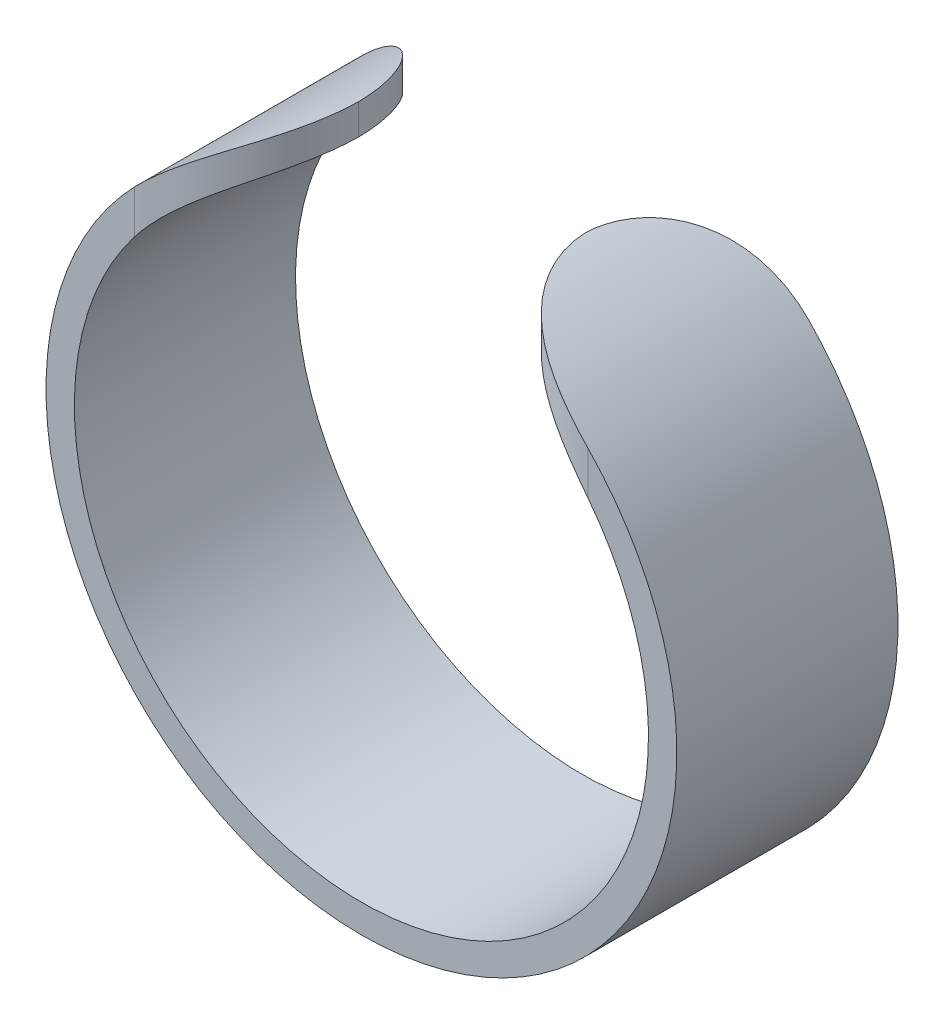
ISO-10303-21;
HEADER;
FILE_DESCRIPTION(('STEP AP214'),'2;1');
FILE_NAME('part.step','',(''),(''),'','','');
FILE_SCHEMA(('AUTOMOTIVE_DESIGN { 1 0 10303 214 1 1 1 1 }'));
ENDSEC;
DATA;
#1=APPLICATION_CONTEXT('core data for automotive mechanical design processes');
#2=APPLICATION_PROTOCOL_DEFINITION('international standard','automotive_design',2000,#1);
#3=PRODUCT_CONTEXT('',#1,'mechanical');
#4=PRODUCT('Part','Part','',(#3));
#5=PRODUCT_RELATED_PRODUCT_CATEGORY('part','',(#4));
#6=PRODUCT_DEFINITION_FORMATION('','',#4);
#7=PRODUCT_DEFINITION_CONTEXT('part definition',#1,'design');
#8=PRODUCT_DEFINITION('design','',#6,#7);
#9=PRODUCT_DEFINITION_SHAPE('','',#8);
#10=(LENGTH_UNIT() NAMED_UNIT(*) SI_UNIT(.MILLI.,.METRE.));
#11=(NAMED_UNIT(*) PLANE_ANGLE_UNIT() SI_UNIT($,.RADIAN.));
#12=(NAMED_UNIT(*) SI_UNIT($,.STERADIAN.) SOLID_ANGLE_UNIT());
#13=UNCERTAINTY_MEASURE_WITH_UNIT(LENGTH_MEASURE(1.E-05),#10,'distance_accuracy_value','');
#14=(GEOMETRIC_REPRESENTATION_CONTEXT(3) GLOBAL_UNCERTAINTY_ASSIGNED_CONTEXT((#13)) GLOBAL_UNIT_ASSIGNED_CONTEXT((#10,
#11,#12)) REPRESENTATION_CONTEXT('',''));
#15=CARTESIAN_POINT('',(0.,0.,0.));
#16=DIRECTION('',(0.,0.,1.));
#17=DIRECTION('',(1.,0.,0.));
#18=AXIS2_PLACEMENT_3D('',#15,#16,#17);
#19=CARTESIAN_POINT('',(0.,0.,7.8));
#20=DIRECTION('',(0.,0.,-1.));
#21=DIRECTION('',(-1.,0.,0.));
#22=AXIS2_PLACEMENT_3D('',#19,#20,#21);
#23=CYLINDRICAL_SURFACE('',#22,10.125);
#24=CARTESIAN_POINT('',(8.,6.2060957936532,7.8));
#25=CARTESIAN_POINT('',(7.89670371233146,6.33929778006769,7.79998869917863));
#26=CARTESIAN_POINT('',(7.78997562346017,6.46996287481344,7.79599541349169));
#27=CARTESIAN_POINT('',(7.57024622908363,6.72572142292962,7.77838130965008));
#28=CARTESIAN_POINT('',(7.45723135562553,6.85080168549803,7.76473886050186));
#29=CARTESIAN_POINT('',(7.22506117159138,7.09526544709978,7.72599290003463));
#30=CARTESIAN_POINT('',(7.10586379230993,7.21459504975585,7.70079811050502));
#31=CARTESIAN_POINT('',(6.8636144774899,7.44542462863248,7.63722369968065));
#32=CARTESIAN_POINT('',(6.74056644616067,7.55693218607161,7.59885706342561));
#33=CARTESIAN_POINT('',(6.52724407473206,7.74110043354562,7.52021995291171));
#34=CARTESIAN_POINT('',(6.43747218308143,7.81587505540554,7.48351125417826));
#35=CARTESIAN_POINT('',(6.25769513800284,7.96053856416283,7.40195928435549));
#36=CARTESIAN_POINT('',(6.16769004261,8.03042856438842,7.35711787534715));
#37=CARTESIAN_POINT('',(5.98871051428425,8.16476904526679,7.25905939142414));
#38=CARTESIAN_POINT('',(5.89973368702158,8.22923641428959,7.20586992092514));
#39=CARTESIAN_POINT('',(5.72361956992846,8.35268624457175,7.09076828695818));
#40=CARTESIAN_POINT('',(5.63648225135428,8.41166879158476,7.02885625990305));
#41=CARTESIAN_POINT('',(5.46453663914782,8.52438388713117,6.89569786337527));
#42=CARTESIAN_POINT('',(5.37975361454636,8.57806890425038,6.82437842654861));
#43=CARTESIAN_POINT('',(5.21457012044728,8.67947450735318,6.67296539246443));
#44=CARTESIAN_POINT('',(5.13416923273609,8.72719566306779,6.59287263470102));
#45=CARTESIAN_POINT('',(4.97897744647333,8.81665694270773,6.4242260338078));
#46=CARTESIAN_POINT('',(4.90419018330925,8.85839320646897,6.33566679074197));
#47=CARTESIAN_POINT('',(4.7615218732755,8.9358898766387,6.15072208561734));
#48=CARTESIAN_POINT('',(4.69363997400165,8.97165102097217,6.0543375921619));
#49=CARTESIAN_POINT('',(4.57299857522466,9.0336807641516,5.86561792550059));
#50=CARTESIAN_POINT('',(4.51939686257234,9.06056241240155,5.77402071848837));
#51=CARTESIAN_POINT('',(4.41923347735347,9.1098362527517,5.58590727602417));
#52=CARTESIAN_POINT('',(4.37267125181529,9.13222879752879,5.48939142774258));
#53=CARTESIAN_POINT('',(4.2872028080801,9.17266347920478,5.29220427111018));
#54=CARTESIAN_POINT('',(4.24829268352289,9.19070783689761,5.19153511492373));
#55=CARTESIAN_POINT('',(4.17859287332483,9.22260527659932,4.98682436855747));
#56=CARTESIAN_POINT('',(4.14780181458378,9.23645906737723,4.88278335197462));
#57=CARTESIAN_POINT('',(4.08119863469879,9.26614357843557,4.61842152343617));
#58=CARTESIAN_POINT('',(4.05079581536745,9.27939699358287,4.45638605987753));
#59=CARTESIAN_POINT('',(4.02034803390626,9.29260613192237,4.21130585313471));
#60=CARTESIAN_POINT('',(4.01272485402084,9.29589735256807,4.12928486750973));
#61=CARTESIAN_POINT('',(4.00255050427163,9.30028131207724,3.9648531630011));
#62=CARTESIAN_POINT('',(4.00000039076879,9.30137359305765,3.88244236652769));
#63=CARTESIAN_POINT('',(4.,9.30137758614282,3.8));
#64=B_SPLINE_CURVE_WITH_KNOTS('',3,(#24,#25,#26,#27,#28,#29,#30,#31,#32,#33,#34,#35,#36,#37,#38,
#39,#40,#41,#42,#43,#44,#45,#46,#47,#48,#49,#50,#51,#52,#53,#54,#55,#56,#57,#58,#59,#60,#61,#62,
#63),.UNSPECIFIED.,.F.,.F.,(4,2,2,2,2,2,2,2,2,2,2,2,2,2,2,2,2,2,2,4),(0.,0.505733789411541,
1.01260491470183,1.52355187632482,2.03399657690524,2.40106442694357,2.76804833827841,
3.13384336864182,3.49963267894004,3.86845176317439,4.23723558693812,4.60625621097568,
4.97523122736603,5.30325241196354,5.63124781616548,5.95907534317505,6.2868473922293,
6.78130148447984,7.02846750504311,7.27568498742378),.UNSPECIFIED.);
#65=CARTESIAN_POINT('',(8.,6.2060957936532,7.8));
#66=VERTEX_POINT('',#65);
#67=CARTESIAN_POINT('',(4.00125019537356,9.30083984777843,3.9));
#68=VERTEX_POINT('',#67);
#69=EDGE_CURVE('E102',#66,#68,#64,.T.);
#70=ORIENTED_EDGE('',*,*,#69,.T.);
#71=CARTESIAN_POINT('',(4.,9.30137758614282,4.));
#72=CARTESIAN_POINT('',(3.99998466528454,9.30137103583187,3.89631177232157));
#73=CARTESIAN_POINT('',(4.00403106948733,9.29964363740306,3.79262519143415));
#74=CARTESIAN_POINT('',(4.02013713954009,9.29269953322129,3.58599952270655));
#75=CARTESIAN_POINT('',(4.03219635319672,9.28748302437199,3.48306039301624));
#76=CARTESIAN_POINT('',(4.06419913597139,9.27352126219605,3.27878140599776));
#77=CARTESIAN_POINT('',(4.08413347352745,9.26478014032654,3.17743982008971));
#78=CARTESIAN_POINT('',(4.13166794222665,9.24368027919424,2.97695664688774));
#79=CARTESIAN_POINT('',(4.15926796690014,9.23132159017614,2.87781502905884));
#80=CARTESIAN_POINT('',(4.22184411336704,9.20287110428469,2.68240078621795));
#81=CARTESIAN_POINT('',(4.25682270347272,9.18677805799598,2.58612913361115));
#82=CARTESIAN_POINT('',(4.33377323963387,9.15072889751504,2.39712899429143));
#83=CARTESIAN_POINT('',(4.37574774546888,9.13077136888908,2.30440181981306));
#84=CARTESIAN_POINT('',(4.46617119473139,9.08688406364328,2.12322144389585));
#85=CARTESIAN_POINT('',(4.51461579264309,9.06295695053048,2.03476542763717));
#86=CARTESIAN_POINT('',(4.61745667143877,9.01099537074587,1.86260476175486));
#87=CARTESIAN_POINT('',(4.67185513703985,8.98295939507663,1.77890187347484));
#88=CARTESIAN_POINT('',(4.78621281396748,8.92255513813978,1.61641298292977));
#89=CARTESIAN_POINT('',(4.8461964703836,8.89016750803642,1.53765138829782));
#90=CARTESIAN_POINT('',(4.97081929177876,8.82109166594482,1.38586302448159));
#91=CARTESIAN_POINT('',(5.03546012727021,8.78440190780864,1.31283833293411));
#92=CARTESIAN_POINT('',(5.16860739808005,8.70672458373014,1.17289229098959));
#93=CARTESIAN_POINT('',(5.23711280628948,8.66573815727484,1.10596933115692));
#94=CARTESIAN_POINT('',(5.37723013770533,8.57949955883178,0.97839899614966));
#95=CARTESIAN_POINT('',(5.44884318915743,8.53424583046468,0.917753927709938));
#96=CARTESIAN_POINT('',(5.67381734016513,8.3878617822521,0.740188342285562));
#97=CARTESIAN_POINT('',(5.83118158711485,8.27960272253525,0.633999144112741));
#98=CARTESIAN_POINT('',(6.14934030277602,8.04613142123063,0.44907987232971));
#99=CARTESIAN_POINT('',(6.31013722986854,7.9209066610591,0.370370230088146));
#100=CARTESIAN_POINT('',(6.58401880869216,7.69340299255251,0.256967808092501));
#101=CARTESIAN_POINT('',(6.69764770168449,7.59474821052417,0.216123280615146));
#102=CARTESIAN_POINT('',(6.9223427991506,7.39052318314502,0.146105134185766));
#103=CARTESIAN_POINT('',(7.03340778992512,7.28494974988087,0.116936939978134));
#104=CARTESIAN_POINT('',(7.25172250660084,7.06766507891942,0.06902300990566));
#105=CARTESIAN_POINT('',(7.35897113409853,6.95595209733941,0.0502802522789817));
#106=CARTESIAN_POINT('',(7.56875504389739,6.72708452304017,0.0219061239506799));
#107=CARTESIAN_POINT('',(7.67129024170778,6.60992983285099,0.0122749165179599));
#108=CARTESIAN_POINT('',(7.81015726948103,6.44366211498761,0.00431638102377072));
#109=CARTESIAN_POINT('',(7.84877175892794,6.39657085793119,0.00267707211315006));
#110=CARTESIAN_POINT('',(7.92506608192559,6.30179674591674,0.000520397670763354));
#111=CARTESIAN_POINT('',(7.96274792592456,6.25411557080989,3.64230484475854E-07));
#112=CARTESIAN_POINT('',(8.,6.2060957936532,0.));
#113=B_SPLINE_CURVE_WITH_KNOTS('',3,(#71,#72,#73,#74,#75,#76,#77,#78,#79,#80,#81,#82,#83,#84,
#85,#86,#87,#88,#89,#90,#91,#92,#93,#94,#95,#96,#97,#98,#99,#100,#101,#102,#103,#104,#105,#106,
#107,#108,#109,#110,#111,#112),.UNSPECIFIED.,.F.,.F.,(4,2,2,2,2,2,2,2,2,2,2,2,2,2,2,2,2,2,2,2,
4),(0.,0.310969061687059,0.621920575696798,0.932508655342433,1.24309242140851,1.55378025064513,
1.86458200997558,2.17517606513996,2.48588447447939,2.79802316983118,3.11027439098508,
3.42244301084117,3.73472592913755,4.3874759791703,5.0407103280053,5.50787660996192,
5.9752596829746,6.44277620499399,6.91030110423379,7.09304889946747,7.27536061184638),.UNSPECIFIED.);
#114=CARTESIAN_POINT('',(8.,6.2060957936532,0.));
#115=VERTEX_POINT('',#114);
#116=EDGE_CURVE('E97',#68,#115,#113,.T.);
#117=ORIENTED_EDGE('',*,*,#116,.T.);
#118=CARTESIAN_POINT('',(0.,0.,0.));
#119=DIRECTION('',(0.,0.,-1.));
#120=DIRECTION('',(1.,0.,0.));
#121=AXIS2_PLACEMENT_3D('',#118,#119,#120);
#122=CIRCLE('',#121,10.125);
#123=CARTESIAN_POINT('',(-8.,6.20609579365321,0.));
#124=VERTEX_POINT('',#123);
#125=EDGE_CURVE('E99',#115,#124,#122,.T.);
#126=ORIENTED_EDGE('',*,*,#125,.T.);
#127=CARTESIAN_POINT('',(-8.,6.20609579365321,0.));
#128=CARTESIAN_POINT('',(-7.89670371233146,6.33929778006769,1.13008213730729E-05));
#129=CARTESIAN_POINT('',(-7.78997562346017,6.46996287481345,0.00400458650831155));
#130=CARTESIAN_POINT('',(-7.57024622908363,6.72572142292963,0.0216186903499209));
#131=CARTESIAN_POINT('',(-7.45723135562552,6.85080168549803,0.0352611394981356));
#132=CARTESIAN_POINT('',(-7.22506117159137,7.09526544709979,0.0740070999653701));
#133=CARTESIAN_POINT('',(-7.10586379230992,7.21459504975585,0.0992018894949793));
#134=CARTESIAN_POINT('',(-6.86361447748989,7.44542462863248,0.162776300319347));
#135=CARTESIAN_POINT('',(-6.74056644616067,7.55693218607161,0.201142936574389));
#136=CARTESIAN_POINT('',(-6.52724407473206,7.74110043354563,0.279780047088289));
#137=CARTESIAN_POINT('',(-6.43747218308143,7.81587505540554,0.316488745821738));
#138=CARTESIAN_POINT('',(-6.25769513800284,7.96053856416283,0.398040715644509));
#139=CARTESIAN_POINT('',(-6.16769004261,8.03042856438842,0.442882124652845));
#140=CARTESIAN_POINT('',(-5.98871051428425,8.16476904526679,0.540940608575862));
#141=CARTESIAN_POINT('',(-5.89973368702158,8.22923641428959,0.594130079074863));
#142=CARTESIAN_POINT('',(-5.72361956992846,8.35268624457175,0.709231713041816));
#143=CARTESIAN_POINT('',(-5.63648225135428,8.41166879158476,0.771143740096952));
#144=CARTESIAN_POINT('',(-5.46453663914782,8.52438388713117,0.904302136624729));
#145=CARTESIAN_POINT('',(-5.37975361454636,8.57806890425038,0.97562157345139));
#146=CARTESIAN_POINT('',(-5.21457012044729,8.67947450735318,1.12703460753557));
#147=CARTESIAN_POINT('',(-5.13416923273609,8.72719566306779,1.20712736529898));
#148=CARTESIAN_POINT('',(-4.97897744647333,8.81665694270773,1.3757739661922));
#149=CARTESIAN_POINT('',(-4.90419018330925,8.85839320646897,1.46433320925803));
#150=CARTESIAN_POINT('',(-4.7615218732755,8.9358898766387,1.64927791438265));
#151=CARTESIAN_POINT('',(-4.69363997400165,8.97165102097217,1.74566240783809));
#152=CARTESIAN_POINT('',(-4.57299857522466,9.0336807641516,1.93438207449941));
#153=CARTESIAN_POINT('',(-4.51939686257234,9.06056241240155,2.02597928151163));
#154=CARTESIAN_POINT('',(-4.41923347735347,9.1098362527517,2.21409272397583));
#155=CARTESIAN_POINT('',(-4.37267125181529,9.13222879752878,2.31060857225742));
#156=CARTESIAN_POINT('',(-4.2872028080801,9.17266347920478,2.50779572888982));
#157=CARTESIAN_POINT('',(-4.24829268352289,9.19070783689761,2.60846488507627));
#158=CARTESIAN_POINT('',(-4.17859287332483,9.22260527659932,2.81317563144252));
#159=CARTESIAN_POINT('',(-4.14780181458378,9.23645906737723,2.91721664802538));
#160=CARTESIAN_POINT('',(-4.08119863469879,9.26614357843557,3.18157847656383));
#161=CARTESIAN_POINT('',(-4.05079581536745,9.27939699358287,3.34361394012246));
#162=CARTESIAN_POINT('',(-4.02034803390626,9.29260613192237,3.58869414686529));
#163=CARTESIAN_POINT('',(-4.01272485402084,9.29589735256807,3.67071513249026));
#164=CARTESIAN_POINT('',(-4.00255050427163,9.30028131207724,3.8351468369989));
#165=CARTESIAN_POINT('',(-4.00000039076879,9.30137359305766,3.91755763347231));
#166=CARTESIAN_POINT('',(-4.,9.30137758614282,4.));
#167=B_SPLINE_CURVE_WITH_KNOTS('',3,(#127,#128,#129,#130,#131,#132,#133,#134,#135,#136,#137,
#138,#139,#140,#141,#142,#143,#144,#145,#146,#147,#148,#149,#150,#151,#152,#153,#154,#155,#156,
#157,#158,#159,#160,#161,#162,#163,#164,#165,#166),.UNSPECIFIED.,.F.,.F.,(4,2,2,2,2,2,2,2,2,2,2,
2,2,2,2,2,2,2,2,4),(0.,0.505733789411543,1.01260491470183,1.52355187632482,2.03399657690524,
2.40106442694357,2.76804833827841,3.13384336864182,3.49963267894003,3.86845176317438,
4.23723558693812,4.60625621097567,4.97523122736602,5.30325241196353,5.63124781616548,
5.95907534317504,6.2868473922293,6.78130148447984,7.0284675050431,7.27568498742378),.UNSPECIFIED.);
#168=CARTESIAN_POINT('',(-4.00125019537356,9.30083984777843,3.9));
#169=VERTEX_POINT('',#168);
#170=EDGE_CURVE('E177',#124,#169,#167,.T.);
#171=ORIENTED_EDGE('',*,*,#170,.T.);
#172=CARTESIAN_POINT('',(-4.,9.30137758614282,3.8));
#173=CARTESIAN_POINT('',(-3.99998466528454,9.30137103583187,3.90368822767843));
#174=CARTESIAN_POINT('',(-4.00403106948733,9.29964363740306,4.00737480856585));
#175=CARTESIAN_POINT('',(-4.02013713954008,9.29269953322128,4.21400047729345));
#176=CARTESIAN_POINT('',(-4.03219635319672,9.28748302437199,4.31693960698376));
#177=CARTESIAN_POINT('',(-4.06419913597139,9.27352126219605,4.52121859400224));
#178=CARTESIAN_POINT('',(-4.08413347352745,9.26478014032654,4.62256017991029));
#179=CARTESIAN_POINT('',(-4.13166794222665,9.24368027919424,4.82304335311226));
#180=CARTESIAN_POINT('',(-4.15926796690014,9.23132159017614,4.92218497094116));
#181=CARTESIAN_POINT('',(-4.22184411336704,9.20287110428469,5.11759921378205));
#182=CARTESIAN_POINT('',(-4.25682270347271,9.18677805799598,5.21387086638885));
#183=CARTESIAN_POINT('',(-4.33377323963387,9.15072889751504,5.40287100570857));
#184=CARTESIAN_POINT('',(-4.37574774546888,9.13077136888908,5.49559818018694));
#185=CARTESIAN_POINT('',(-4.46617119473139,9.08688406364328,5.67677855610415));
#186=CARTESIAN_POINT('',(-4.51461579264309,9.06295695053049,5.76523457236283));
#187=CARTESIAN_POINT('',(-4.61745667143877,9.01099537074587,5.93739523824514));
#188=CARTESIAN_POINT('',(-4.67185513703985,8.98295939507663,6.02109812652516));
#189=CARTESIAN_POINT('',(-4.78621281396748,8.92255513813978,6.18358701707023));
#190=CARTESIAN_POINT('',(-4.8461964703836,8.89016750803642,6.26234861170218));
#191=CARTESIAN_POINT('',(-4.97081929177876,8.82109166594483,6.41413697551841));
#192=CARTESIAN_POINT('',(-5.03546012727021,8.78440190780864,6.48716166706589));
#193=CARTESIAN_POINT('',(-5.16860739808005,8.70672458373014,6.62710770901041));
#194=CARTESIAN_POINT('',(-5.23711280628947,8.66573815727484,6.69403066884308));
#195=CARTESIAN_POINT('',(-5.37723013770533,8.57949955883178,6.82160100385034));
#196=CARTESIAN_POINT('',(-5.44884318915743,8.53424583046468,6.88224607229006));
#197=CARTESIAN_POINT('',(-5.67381734016513,8.3878617822521,7.05981165771444));
#198=CARTESIAN_POINT('',(-5.83118158711485,8.27960272253526,7.16600085588726));
#199=CARTESIAN_POINT('',(-6.14934030277602,8.04613142123063,7.35092012767029));
#200=CARTESIAN_POINT('',(-6.31013722986854,7.9209066610591,7.42962976991185));
#201=CARTESIAN_POINT('',(-6.58401880869216,7.69340299255251,7.5430321919075));
#202=CARTESIAN_POINT('',(-6.69764770168449,7.59474821052417,7.58387671938485));
#203=CARTESIAN_POINT('',(-6.92234279915059,7.39052318314502,7.65389486581423));
#204=CARTESIAN_POINT('',(-7.03340778992512,7.28494974988087,7.68306306002186));
#205=CARTESIAN_POINT('',(-7.25172250660084,7.06766507891942,7.73097699009434));
#206=CARTESIAN_POINT('',(-7.35897113409854,6.95595209733941,7.74971974772102));
#207=CARTESIAN_POINT('',(-7.56875504389739,6.72708452304017,7.77809387604932));
#208=CARTESIAN_POINT('',(-7.67129024170777,6.60992983285099,7.78772508348204));
#209=CARTESIAN_POINT('',(-7.81015726948103,6.44366211498762,7.79568361897623));
#210=CARTESIAN_POINT('',(-7.84877175892794,6.39657085793119,7.79732292788685));
#211=CARTESIAN_POINT('',(-7.92506608192559,6.30179674591675,7.79947960232924));
#212=CARTESIAN_POINT('',(-7.96274792592456,6.25411557080989,7.79999963576951));
#213=CARTESIAN_POINT('',(-8.,6.20609579365321,7.8));
#214=B_SPLINE_CURVE_WITH_KNOTS('',3,(#172,#173,#174,#175,#176,#177,#178,#179,#180,#181,#182,
#183,#184,#185,#186,#187,#188,#189,#190,#191,#192,#193,#194,#195,#196,#197,#198,#199,#200,#201,
#202,#203,#204,#205,#206,#207,#208,#209,#210,#211,#212,#213),.UNSPECIFIED.,.F.,.F.,(4,2,2,2,2,2,
2,2,2,2,2,2,2,2,2,2,2,2,2,2,4),(0.,0.310969061687059,0.621920575696799,0.932508655342433,
1.24309242140851,1.55378025064513,1.86458200997558,2.17517606513996,2.48588447447939,
2.79802316983117,3.11027439098508,3.42244301084117,3.73472592913755,4.38747597917031,
5.0407103280053,5.50787660996193,5.9752596829746,6.44277620499399,6.91030110423379,
7.09304889946747,7.27536061184637),.UNSPECIFIED.);
#215=CARTESIAN_POINT('',(-8.,6.20609579365321,7.8));
#216=VERTEX_POINT('',#215);
#217=EDGE_CURVE('E185',#169,#216,#214,.T.);
#218=ORIENTED_EDGE('',*,*,#217,.T.);
#219=CARTESIAN_POINT('',(0.,0.,7.8));
#220=DIRECTION('',(0.,0.,-1.));
#221=DIRECTION('',(1.,0.,0.));
#222=AXIS2_PLACEMENT_3D('',#219,#220,#221);
#223=CIRCLE('',#222,10.125);
#224=EDGE_CURVE('E192',#66,#216,#223,.T.);
#225=ORIENTED_EDGE('',*,*,#224,.F.);
#226=EDGE_LOOP('',(#70,#117,#126,#171,#218,#225));
#227=FACE_BOUND('',#226,.T.);
#228=ADVANCED_FACE('F41',(#227),#23,.F.);
#229=CARTESIAN_POINT('',(0.,0.,7.8));
#230=DIRECTION('',(0.,0.,-1.));
#231=DIRECTION('',(-1.,0.,0.));
#232=AXIS2_PLACEMENT_3D('',#229,#230,#231);
#233=CYLINDRICAL_SURFACE('',#232,11.125);
#234=CARTESIAN_POINT('',(0.,0.,0.));
#235=DIRECTION('',(0.,0.,1.));
#236=DIRECTION('',(1.,0.,0.));
#237=AXIS2_PLACEMENT_3D('',#234,#235,#236);
#238=CIRCLE('',#237,11.125);
#239=CARTESIAN_POINT('',(-8.,7.73082304803311,0.));
#240=VERTEX_POINT('',#239);
#241=CARTESIAN_POINT('',(8.,7.73082304803311,0.));
#242=VERTEX_POINT('',#241);
#243=EDGE_CURVE('E118',#240,#242,#238,.T.);
#244=ORIENTED_EDGE('',*,*,#243,.T.);
#245=CARTESIAN_POINT('',(8.,7.73082304803311,0.));
#246=CARTESIAN_POINT('',(7.88237004916146,7.85260102974051,1.88540898933767E-06));
#247=CARTESIAN_POINT('',(7.76182854460082,7.97172678058956,0.00519238666689737));
#248=CARTESIAN_POINT('',(7.51574644328083,8.20412564227477,0.0274929932511224));
#249=CARTESIAN_POINT('',(7.39019425048823,8.31738359417235,0.0446324642769837));
#250=CARTESIAN_POINT('',(7.13473294163192,8.53755608735987,0.092533395013003));
#251=CARTESIAN_POINT('',(7.00480200056611,8.64442793908196,0.123376929699097));
#252=CARTESIAN_POINT('',(6.74314097291611,8.85004444879884,0.200149973533621));
#253=CARTESIAN_POINT('',(6.61141308274522,8.94879814452407,0.246062414469757));
#254=CARTESIAN_POINT('',(6.38821504551921,9.10873631632951,0.337764301015103));
#255=CARTESIAN_POINT('',(6.2966596579245,9.17222705819268,0.379362514115933));
#256=CARTESIAN_POINT('',(6.11457816454844,9.29459929939618,0.470757344428826));
#257=CARTESIAN_POINT('',(6.02405180495615,9.35348195737923,0.520551890944379));
#258=CARTESIAN_POINT('',(5.84524756841746,9.4662479146026,0.628366995467892));
#259=CARTESIAN_POINT('',(5.75696398615371,9.52014507113801,0.686363545359403));
#260=CARTESIAN_POINT('',(5.58345894920887,9.62292959439915,0.810687770916096));
#261=CARTESIAN_POINT('',(5.49823610673458,9.67181925072143,0.877011607911093));
#262=CARTESIAN_POINT('',(5.33134026601019,9.76481564370122,1.01834098009348));
#263=CARTESIAN_POINT('',(5.24969470821134,9.80888833626745,1.09340142414511));
#264=CARTESIAN_POINT('',(5.09170529009106,9.89182094226319,1.2514906171959));
#265=CARTESIAN_POINT('',(5.01535923098459,9.9306830239084,1.33451602702298));
#266=CARTESIAN_POINT('',(4.86892147965024,10.0032953760114,1.50816125779387));
#267=CARTESIAN_POINT('',(4.79883661075207,10.037040096926,1.5987891602523));
#268=CARTESIAN_POINT('',(4.6660135450032,10.0994718038658,1.78690520251702));
#269=CARTESIAN_POINT('',(4.6032746406379,10.1281592771064,1.8843926802042));
#270=CARTESIAN_POINT('',(4.49112926729879,10.178350723129,2.07669107295757));
#271=CARTESIAN_POINT('',(4.44103777797437,10.2002624970612,2.17099714808468));
#272=CARTESIAN_POINT('',(4.34829496298892,10.2401418524747,2.36399525025523));
#273=CARTESIAN_POINT('',(4.305643174821,10.2581096791588,2.46268700417346));
#274=CARTESIAN_POINT('',(4.22829632201133,10.2902327518299,2.6636497284932));
#275=CARTESIAN_POINT('',(4.19359479482324,10.3043910960841,2.76591771336479));
#276=CARTESIAN_POINT('',(4.13249939519054,10.3290442829836,2.9732926864554));
#277=CARTESIAN_POINT('',(4.10610336143729,10.3395400787984,3.07839892834179));
#278=CARTESIAN_POINT('',(4.05614211931768,10.3592592875681,3.31835744048974));
#279=CARTESIAN_POINT('',(4.03509870877475,10.3674417914848,3.45383637237645));
#280=CARTESIAN_POINT('',(4.01404691120152,10.3756011573755,3.65813722175456));
#281=CARTESIAN_POINT('',(4.00878187376547,10.3776352234768,3.72638523366129));
#282=CARTESIAN_POINT('',(4.00175856974739,10.3803449722167,3.86308340858143));
#283=CARTESIAN_POINT('',(4.00000004878521,10.3810207533921,3.93153355657006));
#284=CARTESIAN_POINT('',(4.,10.3810223484973,4.));
#285=B_SPLINE_CURVE_WITH_KNOTS('',3,(#245,#246,#247,#248,#249,#250,#251,#252,#253,#254,#255,
#256,#257,#258,#259,#260,#261,#262,#263,#264,#265,#266,#267,#268,#269,#270,#271,#272,#273,#274,
#275,#276,#277,#278,#279,#280,#281,#282,#283,#284),.UNSPECIFIED.,.F.,.F.,(4,2,2,2,2,2,2,2,2,2,2,
2,2,2,2,2,2,2,2,4),(0.,0.507988318555866,1.01722948664995,1.52956254612761,2.04131728865144,
2.39776436525957,2.75412152799827,3.10945639319971,3.46462805524333,3.82216655372621,
4.17955581010409,4.53732990904327,4.89506952115967,5.22169034062768,5.54829084768554,
5.87462492078682,6.20087400278062,6.61197565262608,6.81733144971736,7.0226723487353),.UNSPECIFIED.);
#286=CARTESIAN_POINT('',(4.00125019537356,10.3805405386243,3.90000000000008));
#287=VERTEX_POINT('',#286);
#288=EDGE_CURVE('E60',#242,#287,#285,.T.);
#289=ORIENTED_EDGE('',*,*,#288,.T.);
#290=CARTESIAN_POINT('',(4.,10.3810223484973,3.8));
#291=CARTESIAN_POINT('',(3.99998508815545,10.3810159686296,3.9052637782079));
#292=CARTESIAN_POINT('',(4.00415454173049,10.3794211462908,4.01052589971571));
#293=CARTESIAN_POINT('',(4.02075495691837,10.3730082912354,4.22029221896464));
#294=CARTESIAN_POINT('',(4.03318546069245,10.3681904371436,4.32479645838417));
#295=CARTESIAN_POINT('',(4.0661798987854,10.3552933631649,4.53217302145055));
#296=CARTESIAN_POINT('',(4.08673352712237,10.3472182755331,4.63504724178842));
#297=CARTESIAN_POINT('',(4.13576190731851,10.3277199065917,4.83856497336804));
#298=CARTESIAN_POINT('',(4.16423655028099,10.3162966713118,4.93920851525621));
#299=CARTESIAN_POINT('',(4.22882566668444,10.2899889381992,5.13758327380175));
#300=CARTESIAN_POINT('',(4.26494249511597,10.2751033732859,5.2353135821111));
#301=CARTESIAN_POINT('',(4.34444601125633,10.24174164605,5.42717915281759));
#302=CARTESIAN_POINT('',(4.38783536157164,10.2232641682635,5.52131308295688));
#303=CARTESIAN_POINT('',(4.48138870394747,10.1826017647911,5.70526030999741));
#304=CARTESIAN_POINT('',(4.53154962046618,10.1604185211275,5.79507554341442));
#305=CARTESIAN_POINT('',(4.63813440705996,10.11220821633,5.96987148118495));
#306=CARTESIAN_POINT('',(4.69456057846786,10.0861797416104,6.05485039162471));
#307=CARTESIAN_POINT('',(4.81329403460291,10.0300624699428,6.21976707513897));
#308=CARTESIAN_POINT('',(4.87562550215386,9.99995673941362,6.29968166705316));
#309=CARTESIAN_POINT('',(5.00529185717865,9.93568902741466,6.45365003577353));
#310=CARTESIAN_POINT('',(5.07262854510413,9.90152558365757,6.52770168361761));
#311=CARTESIAN_POINT('',(5.21148639456106,9.82914799804123,6.66949922382902));
#312=CARTESIAN_POINT('',(5.28300371794502,9.79093754627076,6.73725075659154));
#313=CARTESIAN_POINT('',(5.42951600064035,9.71045782167061,6.86629422001757));
#314=CARTESIAN_POINT('',(5.5045122195738,9.66818707268202,6.92758378425569));
#315=CARTESIAN_POINT('',(5.7395025148843,9.53190426465185,7.10601347347654));
#316=CARTESIAN_POINT('',(5.90407087411254,9.43118664611331,7.21223488241352));
#317=CARTESIAN_POINT('',(6.23859977461278,9.2133313135836,7.39640343442976));
#318=CARTESIAN_POINT('',(6.40857401646372,9.09614879329186,7.47427126910699));
#319=CARTESIAN_POINT('',(6.70153009539369,8.88136214878197,7.58568446193859));
#320=CARTESIAN_POINT('',(6.82467484069688,8.78714468772748,7.62552636561966));
#321=CARTESIAN_POINT('',(7.06910960750221,8.59172908778398,7.69223600910073));
#322=CARTESIAN_POINT('',(7.1903977682217,8.4905244424938,7.71909146463094));
#323=CARTESIAN_POINT('',(7.42903393222575,8.28251098912859,7.76088514726412));
#324=CARTESIAN_POINT('',(7.54639865354178,8.17573285207252,7.77588250048701));
#325=CARTESIAN_POINT('',(7.77668451790301,7.95701711812912,7.79542753768978));
#326=CARTESIAN_POINT('',(7.88961423523152,7.84509048781535,7.79999647084023));
#327=CARTESIAN_POINT('',(8.,7.73082304803311,7.8));
#328=B_SPLINE_CURVE_WITH_KNOTS('',3,(#290,#291,#292,#293,#294,#295,#296,#297,#298,#299,#300,
#301,#302,#303,#304,#305,#306,#307,#308,#309,#310,#311,#312,#313,#314,#315,#316,#317,#318,#319,
#320,#321,#322,#323,#324,#325,#326,#327),.UNSPECIFIED.,.F.,.F.,(4,2,2,2,2,2,2,2,2,2,2,2,2,2,2,2,
2,2,4),(0.,0.315694391283566,0.631371287808981,0.946648957424542,1.26192229287309,
1.57729292376666,1.89277927097986,2.20812280820072,2.52358256197128,2.84039513077127,
3.15732221843033,3.4739627778943,3.79071889386528,4.44853077864106,5.10816876012824,
5.58775425864501,6.06779252830317,6.54542189599574,7.02207716376364),.UNSPECIFIED.);
#329=CARTESIAN_POINT('',(8.,7.73082304803311,7.8));
#330=VERTEX_POINT('',#329);
#331=EDGE_CURVE('E153',#287,#330,#328,.T.);
#332=ORIENTED_EDGE('',*,*,#331,.T.);
#333=CARTESIAN_POINT('',(0.,0.,7.8));
#334=DIRECTION('',(0.,0.,1.));
#335=DIRECTION('',(1.,0.,0.));
#336=AXIS2_PLACEMENT_3D('',#333,#334,#335);
#337=CIRCLE('',#336,11.125);
#338=CARTESIAN_POINT('',(-8.,7.73082304803312,7.8));
#339=VERTEX_POINT('',#338);
#340=EDGE_CURVE('E190',#339,#330,#337,.T.);
#341=ORIENTED_EDGE('',*,*,#340,.F.);
#342=CARTESIAN_POINT('',(-8.,7.73082304803312,7.8));
#343=CARTESIAN_POINT('',(-7.88237004916145,7.85260102974051,7.79999811459101));
#344=CARTESIAN_POINT('',(-7.76182854460082,7.97172678058956,7.7948076133331));
#345=CARTESIAN_POINT('',(-7.51574644328082,8.20412564227477,7.77250700674888));
#346=CARTESIAN_POINT('',(-7.39019425048822,8.31738359417235,7.75536753572302));
#347=CARTESIAN_POINT('',(-7.13473294163192,8.53755608735987,7.707466604987));
#348=CARTESIAN_POINT('',(-7.00480200056611,8.64442793908196,7.6766230703009));
#349=CARTESIAN_POINT('',(-6.74314097291611,8.85004444879884,7.59985002646638));
#350=CARTESIAN_POINT('',(-6.61141308274522,8.94879814452407,7.55393758553024));
#351=CARTESIAN_POINT('',(-6.38821504551921,9.10873631632952,7.4622356989849));
#352=CARTESIAN_POINT('',(-6.2966596579245,9.17222705819268,7.42063748588407));
#353=CARTESIAN_POINT('',(-6.11457816454843,9.29459929939618,7.32924265557117));
#354=CARTESIAN_POINT('',(-6.02405180495615,9.35348195737923,7.27944810905562));
#355=CARTESIAN_POINT('',(-5.84524756841746,9.4662479146026,7.17163300453211));
#356=CARTESIAN_POINT('',(-5.75696398615371,9.52014507113802,7.1136364546406));
#357=CARTESIAN_POINT('',(-5.58345894920887,9.62292959439916,6.9893122290839));
#358=CARTESIAN_POINT('',(-5.49823610673458,9.67181925072144,6.92298839208891));
#359=CARTESIAN_POINT('',(-5.33134026601019,9.76481564370122,6.78165901990652));
#360=CARTESIAN_POINT('',(-5.24969470821134,9.80888833626745,6.70659857585489));
#361=CARTESIAN_POINT('',(-5.09170529009106,9.8918209422632,6.5485093828041));
#362=CARTESIAN_POINT('',(-5.01535923098459,9.9306830239084,6.46548397297702));
#363=CARTESIAN_POINT('',(-4.86892147965024,10.0032953760114,6.29183874220613));
#364=CARTESIAN_POINT('',(-4.79883661075207,10.037040096926,6.2012108397477));
#365=CARTESIAN_POINT('',(-4.6660135450032,10.0994718038658,6.01309479748298));
#366=CARTESIAN_POINT('',(-4.6032746406379,10.1281592771064,5.9156073197958));
#367=CARTESIAN_POINT('',(-4.49112926729879,10.178350723129,5.72330892704244));
#368=CARTESIAN_POINT('',(-4.44103777797437,10.2002624970612,5.62900285191532));
#369=CARTESIAN_POINT('',(-4.34829496298892,10.2401418524747,5.43600474974477));
#370=CARTESIAN_POINT('',(-4.305643174821,10.2581096791588,5.33731299582655));
#371=CARTESIAN_POINT('',(-4.22829632201133,10.2902327518299,5.1363502715068));
#372=CARTESIAN_POINT('',(-4.19359479482324,10.3043910960841,5.03408228663522));
#373=CARTESIAN_POINT('',(-4.13249939519054,10.3290442829836,4.82670731354461));
#374=CARTESIAN_POINT('',(-4.10610336143729,10.3395400787984,4.72160107165821));
#375=CARTESIAN_POINT('',(-4.05614211931768,10.3592592875681,4.48164255951026));
#376=CARTESIAN_POINT('',(-4.03509870877475,10.3674417914848,4.34616362762355));
#377=CARTESIAN_POINT('',(-4.01404691120152,10.3756011573755,4.14186277824544));
#378=CARTESIAN_POINT('',(-4.00878187376547,10.3776352234768,4.07361476633871));
#379=CARTESIAN_POINT('',(-4.00175856974739,10.3803449722167,3.93691659141857));
#380=CARTESIAN_POINT('',(-4.00000004878521,10.3810207533921,3.86846644342994));
#381=CARTESIAN_POINT('',(-4.,10.3810223484973,3.8));
#382=B_SPLINE_CURVE_WITH_KNOTS('',3,(#342,#343,#344,#345,#346,#347,#348,#349,#350,#351,#352,
#353,#354,#355,#356,#357,#358,#359,#360,#361,#362,#363,#364,#365,#366,#367,#368,#369,#370,#371,
#372,#373,#374,#375,#376,#377,#378,#379,#380,#381),.UNSPECIFIED.,.F.,.F.,(4,2,2,2,2,2,2,2,2,2,2,
2,2,2,2,2,2,2,2,4),(0.,0.507988318555868,1.01722948664995,1.52956254612761,2.04131728865144,
2.39776436525957,2.75412152799827,3.10945639319971,3.46462805524333,3.82216655372621,
4.17955581010409,4.53732990904327,4.89506952115967,5.22169034062768,5.54829084768554,
5.87462492078681,6.20087400278061,6.61197565262608,6.81733144971736,7.0226723487353),.UNSPECIFIED.);
#383=CARTESIAN_POINT('',(-4.00125019537356,10.3805405386245,3.90000000000008));
#384=VERTEX_POINT('',#383);
#385=EDGE_CURVE('E67',#339,#384,#382,.T.);
#386=ORIENTED_EDGE('',*,*,#385,.T.);
#387=CARTESIAN_POINT('',(-4.,10.3810223484973,4.));
#388=CARTESIAN_POINT('',(-3.99998508815545,10.3810159686296,3.8947362217921));
#389=CARTESIAN_POINT('',(-4.00415454173049,10.3794211462908,3.78947410028429));
#390=CARTESIAN_POINT('',(-4.02075495691837,10.3730082912354,3.57970778103536));
#391=CARTESIAN_POINT('',(-4.03318546069245,10.3681904371436,3.47520354161583));
#392=CARTESIAN_POINT('',(-4.0661798987854,10.3552933631649,3.26782697854945));
#393=CARTESIAN_POINT('',(-4.08673352712237,10.3472182755331,3.16495275821158));
#394=CARTESIAN_POINT('',(-4.13576190731851,10.3277199065917,2.96143502663196));
#395=CARTESIAN_POINT('',(-4.16423655028099,10.3162966713118,2.86079148474379));
#396=CARTESIAN_POINT('',(-4.22882566668444,10.2899889381992,2.66241672619825));
#397=CARTESIAN_POINT('',(-4.26494249511597,10.2751033732859,2.5646864178889));
#398=CARTESIAN_POINT('',(-4.34444601125633,10.24174164605,2.37282084718241));
#399=CARTESIAN_POINT('',(-4.38783536157164,10.2232641682635,2.27868691704311));
#400=CARTESIAN_POINT('',(-4.48138870394747,10.1826017647911,2.09473969000259));
#401=CARTESIAN_POINT('',(-4.53154962046619,10.1604185211275,2.00492445658558));
#402=CARTESIAN_POINT('',(-4.63813440705996,10.11220821633,1.83012851881505));
#403=CARTESIAN_POINT('',(-4.69456057846786,10.0861797416104,1.74514960837529));
#404=CARTESIAN_POINT('',(-4.81329403460291,10.0300624699428,1.58023292486103));
#405=CARTESIAN_POINT('',(-4.87562550215386,9.99995673941362,1.50031833294684));
#406=CARTESIAN_POINT('',(-5.00529185717865,9.93568902741467,1.34634996422647));
#407=CARTESIAN_POINT('',(-5.07262854510413,9.90152558365757,1.27229831638239));
#408=CARTESIAN_POINT('',(-5.21148639456106,9.82914799804123,1.13050077617098));
#409=CARTESIAN_POINT('',(-5.28300371794502,9.79093754627076,1.06274924340846));
#410=CARTESIAN_POINT('',(-5.42951600064035,9.71045782167061,0.933705779982429));
#411=CARTESIAN_POINT('',(-5.5045122195738,9.66818707268202,0.872416215744304));
#412=CARTESIAN_POINT('',(-5.7395025148843,9.53190426465185,0.693986526523458));
#413=CARTESIAN_POINT('',(-5.90407087411254,9.43118664611331,0.587765117586476));
#414=CARTESIAN_POINT('',(-6.23859977461278,9.2133313135836,0.403596565570243));
#415=CARTESIAN_POINT('',(-6.40857401646372,9.09614879329186,0.325728730893011));
#416=CARTESIAN_POINT('',(-6.70153009539369,8.88136214878197,0.21431553806141));
#417=CARTESIAN_POINT('',(-6.82467484069688,8.78714468772748,0.174473634380338));
#418=CARTESIAN_POINT('',(-7.06910960750221,8.59172908778398,0.107763990899268));
#419=CARTESIAN_POINT('',(-7.1903977682217,8.4905244424938,0.0809085353690584));
#420=CARTESIAN_POINT('',(-7.42903393222575,8.28251098912859,0.039114852735885));
#421=CARTESIAN_POINT('',(-7.54639865354178,8.17573285207252,0.0241174995129926));
#422=CARTESIAN_POINT('',(-7.77668451790301,7.95701711812912,0.00457246231021487));
#423=CARTESIAN_POINT('',(-7.88961423523152,7.84509048781535,3.52915976944134E-06));
#424=CARTESIAN_POINT('',(-8.,7.73082304803311,0.));
#425=B_SPLINE_CURVE_WITH_KNOTS('',3,(#387,#388,#389,#390,#391,#392,#393,#394,#395,#396,#397,
#398,#399,#400,#401,#402,#403,#404,#405,#406,#407,#408,#409,#410,#411,#412,#413,#414,#415,#416,
#417,#418,#419,#420,#421,#422,#423,#424),.UNSPECIFIED.,.F.,.F.,(4,2,2,2,2,2,2,2,2,2,2,2,2,2,2,2,
2,2,4),(0.,0.315694391283567,0.631371287808981,0.946648957424543,1.26192229287309,
1.57729292376666,1.89277927097987,2.20812280820072,2.52358256197128,2.84039513077127,
3.15732221843033,3.4739627778943,3.79071889386528,4.44853077864106,5.10816876012825,
5.58775425864501,6.06779252830317,6.54542189599574,7.02207716376364),.UNSPECIFIED.);
#426=EDGE_CURVE('E127',#384,#240,#425,.T.);
#427=ORIENTED_EDGE('',*,*,#426,.T.);
#428=EDGE_LOOP('',(#244,#289,#332,#341,#386,#427));
#429=FACE_BOUND('',#428,.T.);
#430=ADVANCED_FACE('F140',(#429),#233,.T.);
#431=CARTESIAN_POINT('',(0.,0.,7.8));
#432=DIRECTION('',(0.,0.,1.));
#433=DIRECTION('',(1.,0.,0.));
#434=AXIS2_PLACEMENT_3D('',#431,#432,#433);
#435=PLANE('',#434);
#436=ORIENTED_EDGE('',*,*,#340,.T.);
#437=DIRECTION('',(0.,-1.,0.));
#438=VECTOR('',#437,1.);
#439=CARTESIAN_POINT('',(8.,9.30137758614282,7.8));
#440=LINE('',#439,#438);
#441=EDGE_CURVE('E11',#330,#66,#440,.T.);
#442=ORIENTED_EDGE('',*,*,#441,.T.);
#443=ORIENTED_EDGE('',*,*,#224,.T.);
#444=DIRECTION('',(0.,1.,0.));
#445=VECTOR('',#444,1.);
#446=CARTESIAN_POINT('',(-8.,10.3810223484973,7.8));
#447=LINE('',#446,#445);
#448=EDGE_CURVE('E52',#216,#339,#447,.T.);
#449=ORIENTED_EDGE('',*,*,#448,.T.);
#450=EDGE_LOOP('',(#436,#442,#443,#449));
#451=FACE_BOUND('',#450,.T.);
#452=ADVANCED_FACE('F145',(#451),#435,.T.);
#453=CARTESIAN_POINT('',(0.,0.,0.));
#454=DIRECTION('',(0.,0.,1.));
#455=DIRECTION('',(1.,0.,0.));
#456=AXIS2_PLACEMENT_3D('',#453,#454,#455);
#457=PLANE('',#456);
#458=ORIENTED_EDGE('',*,*,#125,.F.);
#459=DIRECTION('',(0.,-1.,0.));
#460=VECTOR('',#459,1.);
#461=CARTESIAN_POINT('',(8.,0.,0.));
#462=LINE('',#461,#460);
#463=EDGE_CURVE('E115',#115,#242,#462,.F.);
#464=ORIENTED_EDGE('',*,*,#463,.T.);
#465=ORIENTED_EDGE('',*,*,#243,.F.);
#466=DIRECTION('',(0.,1.,0.));
#467=VECTOR('',#466,1.);
#468=CARTESIAN_POINT('',(-7.99999999999999,0.,0.));
#469=LINE('',#468,#467);
#470=EDGE_CURVE('E108',#240,#124,#469,.F.);
#471=ORIENTED_EDGE('',*,*,#470,.T.);
#472=EDGE_LOOP('',(#458,#464,#465,#471));
#473=FACE_BOUND('',#472,.T.);
#474=ADVANCED_FACE('F113',(#473),#457,.F.);
#475=CARTESIAN_POINT('',(8.,0.,3.8));
#476=DIRECTION('',(0.,1.,0.));
#477=DIRECTION('',(0.,0.,1.));
#478=AXIS2_PLACEMENT_3D('',#475,#476,#477);
#479=CYLINDRICAL_SURFACE('',#478,4.);
#480=ORIENTED_EDGE('',*,*,#441,.F.);
#481=ORIENTED_EDGE('',*,*,#331,.F.);
#482=DIRECTION('',(0.,1.,0.));
#483=VECTOR('',#482,1.);
#484=CARTESIAN_POINT('',(4.00125019537356,8.29355907107524,3.9));
#485=LINE('',#484,#483);
#486=EDGE_CURVE('E119',#68,#287,#485,.T.);
#487=ORIENTED_EDGE('',*,*,#486,.F.);
#488=ORIENTED_EDGE('',*,*,#69,.F.);
#489=EDGE_LOOP('',(#480,#481,#487,#488));
#490=FACE_BOUND('',#489,.T.);
#491=ADVANCED_FACE('F163',(#490),#479,.T.);
#492=CARTESIAN_POINT('',(8.,10.3810223484973,4.));
#493=DIRECTION('',(0.,-1.,0.));
#494=DIRECTION('',(0.,0.,-1.));
#495=AXIS2_PLACEMENT_3D('',#492,#493,#494);
#496=CYLINDRICAL_SURFACE('',#495,4.);
#497=ORIENTED_EDGE('',*,*,#288,.F.);
#498=ORIENTED_EDGE('',*,*,#463,.F.);
#499=ORIENTED_EDGE('',*,*,#116,.F.);
#500=ORIENTED_EDGE('',*,*,#486,.T.);
#501=EDGE_LOOP('',(#497,#498,#499,#500));
#502=FACE_BOUND('',#501,.T.);
#503=ADVANCED_FACE('F121',(#502),#496,.T.);
#504=CARTESIAN_POINT('',(-7.99999999999999,0.,3.8));
#505=DIRECTION('',(0.,-1.,0.));
#506=DIRECTION('',(1.,0.,0.));
#507=AXIS2_PLACEMENT_3D('',#504,#505,#506);
#508=CYLINDRICAL_SURFACE('',#507,4.);
#509=ORIENTED_EDGE('',*,*,#448,.F.);
#510=ORIENTED_EDGE('',*,*,#217,.F.);
#511=DIRECTION('',(0.,-1.,0.));
#512=VECTOR('',#511,1.);
#513=CARTESIAN_POINT('',(-4.00125019537356,8.29355907107525,3.9));
#514=LINE('',#513,#512);
#515=EDGE_CURVE('E46',#384,#169,#514,.T.);
#516=ORIENTED_EDGE('',*,*,#515,.F.);
#517=ORIENTED_EDGE('',*,*,#385,.F.);
#518=EDGE_LOOP('',(#509,#510,#516,#517));
#519=FACE_BOUND('',#518,.T.);
#520=ADVANCED_FACE('F43',(#519),#508,.T.);
#521=CARTESIAN_POINT('',(-8.,10.3810223484973,4.));
#522=DIRECTION('',(0.,1.,0.));
#523=DIRECTION('',(-1.,0.,0.));
#524=AXIS2_PLACEMENT_3D('',#521,#522,#523);
#525=CYLINDRICAL_SURFACE('',#524,4.);
#526=ORIENTED_EDGE('',*,*,#170,.F.);
#527=ORIENTED_EDGE('',*,*,#470,.F.);
#528=ORIENTED_EDGE('',*,*,#426,.F.);
#529=ORIENTED_EDGE('',*,*,#515,.T.);
#530=EDGE_LOOP('',(#526,#527,#528,#529));
#531=FACE_BOUND('',#530,.T.);
#532=ADVANCED_FACE('F168',(#531),#525,.T.);
#533=CLOSED_SHELL('',(#228,#430,#452,#474,#491,#503,#520,#532));
#534=MANIFOLD_SOLID_BREP('B2',#533);
#535=ADVANCED_BREP_SHAPE_REPRESENTATION('',(#18,#534),#14);
#536=SHAPE_DEFINITION_REPRESENTATION(#9,#535);
ENDSEC;
END-ISO-10303-21;
